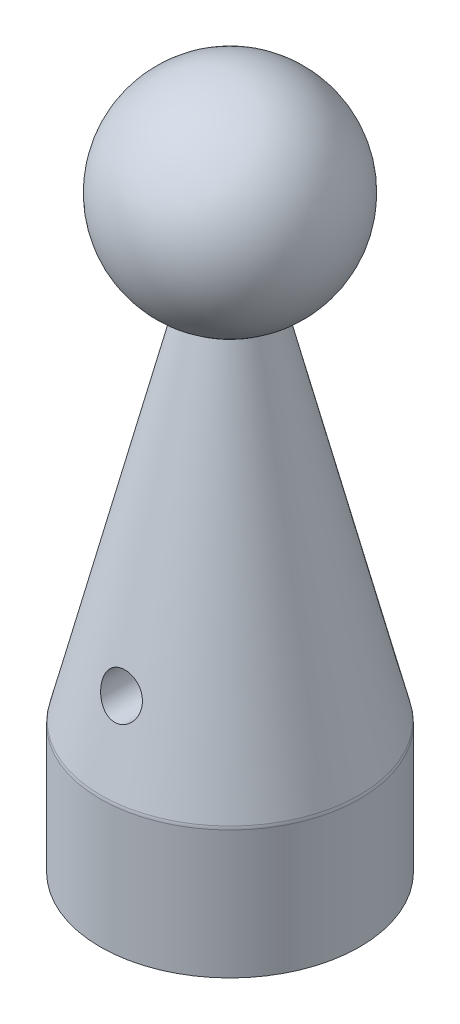
ISO-10303-21;
HEADER;
FILE_DESCRIPTION(('STEP AP214'),'2;1');
FILE_NAME('part.step','',(''),(''),'','','');
FILE_SCHEMA(('AUTOMOTIVE_DESIGN { 1 0 10303 214 1 1 1 1 }'));
ENDSEC;
DATA;
#1=APPLICATION_CONTEXT('core data for automotive mechanical design processes');
#2=APPLICATION_PROTOCOL_DEFINITION('international standard','automotive_design',2000,#1);
#3=PRODUCT_CONTEXT('',#1,'mechanical');
#4=PRODUCT('Part','Part','',(#3));
#5=PRODUCT_RELATED_PRODUCT_CATEGORY('part','',(#4));
#6=PRODUCT_DEFINITION_FORMATION('','',#4);
#7=PRODUCT_DEFINITION_CONTEXT('part definition',#1,'design');
#8=PRODUCT_DEFINITION('design','',#6,#7);
#9=PRODUCT_DEFINITION_SHAPE('','',#8);
#10=(LENGTH_UNIT() NAMED_UNIT(*) SI_UNIT(.MILLI.,.METRE.));
#11=(NAMED_UNIT(*) PLANE_ANGLE_UNIT() SI_UNIT($,.RADIAN.));
#12=(NAMED_UNIT(*) SI_UNIT($,.STERADIAN.) SOLID_ANGLE_UNIT());
#13=UNCERTAINTY_MEASURE_WITH_UNIT(LENGTH_MEASURE(1.E-05),#10,'distance_accuracy_value','');
#14=(GEOMETRIC_REPRESENTATION_CONTEXT(3) GLOBAL_UNCERTAINTY_ASSIGNED_CONTEXT((#13)) GLOBAL_UNIT_ASSIGNED_CONTEXT((#10,
#11,#12)) REPRESENTATION_CONTEXT('',''));
#15=CARTESIAN_POINT('',(0.,0.,0.));
#16=DIRECTION('',(0.,0.,1.));
#17=DIRECTION('',(1.,0.,0.));
#18=AXIS2_PLACEMENT_3D('',#15,#16,#17);
#19=CARTESIAN_POINT('',(0.,72.009,0.));
#20=DIRECTION('',(0.,-1.,0.));
#21=DIRECTION('',(1.,0.,0.));
#22=AXIS2_PLACEMENT_3D('',#19,#20,#21);
#23=SPHERICAL_SURFACE('',#22,12.7);
#24=CARTESIAN_POINT('',(0.,60.2357849017356,0.));
#25=DIRECTION('',(0.,-1.,0.));
#26=DIRECTION('',(0.,0.,-1.));
#27=AXIS2_PLACEMENT_3D('',#24,#25,#26);
#28=CIRCLE('',#27,4.7625);
#29=CARTESIAN_POINT('',(0.,60.2357849017356,-4.7625));
#30=VERTEX_POINT('',#29);
#31=EDGE_CURVE('E71',#30,#30,#28,.T.);
#32=ORIENTED_EDGE('',*,*,#31,.F.);
#33=EDGE_LOOP('',(#32));
#34=FACE_BOUND('',#33,.T.);
#35=ADVANCED_FACE('F35',(#34),#23,.T.);
#36=CARTESIAN_POINT('',(0.,15.875,0.));
#37=DIRECTION('',(0.,-1.,0.));
#38=DIRECTION('',(0.,0.,-1.));
#39=AXIS2_PLACEMENT_3D('',#36,#37,#38);
#40=CONICAL_SURFACE('',#39,15.875,0.245451813077684);
#41=CARTESIAN_POINT('',(0.,16.0664620543454,0.));
#42=DIRECTION('',(0.,1.,0.));
#43=DIRECTION('',(0.,0.,1.));
#44=AXIS2_PLACEMENT_3D('',#41,#42,#43);
#45=CIRCLE('',#44,15.8270382228667);
#46=CARTESIAN_POINT('',(0.,16.0664620543454,15.8270382228667));
#47=VERTEX_POINT('',#46);
#48=EDGE_CURVE('E174',#47,#47,#45,.T.);
#49=ORIENTED_EDGE('',*,*,#48,.T.);
#50=EDGE_LOOP('',(#49));
#51=FACE_BOUND('',#50,.T.);
#52=CARTESIAN_POINT('',(-1.58481914112109,23.4970012948583,-13.8754529950029));
#53=CARTESIAN_POINT('',(-1.6961829974814,23.5897522619588,-13.8393471086549));
#54=CARTESIAN_POINT('',(-1.79894269077523,23.6919255954184,-13.8004221577041));
#55=CARTESIAN_POINT('',(-1.98477756512118,23.9118781970244,-13.719259164654));
#56=CARTESIAN_POINT('',(-2.0678185568569,24.0296840263871,-13.6770155347589));
#57=CARTESIAN_POINT('',(-2.21207792475191,24.277386933347,-13.5915633702038));
#58=CARTESIAN_POINT('',(-2.27333159818721,24.4072640198637,-13.5483565178666));
#59=CARTESIAN_POINT('',(-2.37259631399215,24.675889208675,-13.4630049489034));
#60=CARTESIAN_POINT('',(-2.41061582390072,24.8146340587841,-13.4208598507033));
#61=CARTESIAN_POINT('',(-2.46248204757768,25.0992906698377,-13.3389371298532));
#62=CARTESIAN_POINT('',(-2.47600952646931,25.2452719490148,-13.2991972092676));
#63=CARTESIAN_POINT('',(-2.47696392774469,25.5385117917878,-13.2242928931891));
#64=CARTESIAN_POINT('',(-2.46439441660691,25.6857701781123,-13.189127873177));
#65=CARTESIAN_POINT('',(-2.41376499493418,25.9720143992584,-13.1255850793992));
#66=CARTESIAN_POINT('',(-2.37657529029136,26.1111119714139,-13.0970190316862));
#67=CARTESIAN_POINT('',(-2.27817455875988,26.3816706050399,-13.0456968924899));
#68=CARTESIAN_POINT('',(-2.21696967804379,26.51313361054,-13.0229393169095));
#69=CARTESIAN_POINT('',(-2.07505832373118,26.7588572648069,-12.9839557778314));
#70=CARTESIAN_POINT('',(-1.99524959624132,26.8736009832207,-12.9675011701351));
#71=CARTESIAN_POINT('',(-1.81712702073895,27.0883594104736,-12.9393340916822));
#72=CARTESIAN_POINT('',(-1.71881473598572,27.1883753623057,-12.9276212205869));
#73=CARTESIAN_POINT('',(-1.50816210203445,27.3691283332448,-12.9082864633968));
#74=CARTESIAN_POINT('',(-1.39606288156029,27.4501402172724,-12.9006039648537));
#75=CARTESIAN_POINT('',(-1.15983515940044,27.592452646085,-12.8881901690619));
#76=CARTESIAN_POINT('',(-1.03570657507021,27.653753055435,-12.8834588920904));
#77=CARTESIAN_POINT('',(-0.778592152559872,27.7549918128658,-12.8761464762223));
#78=CARTESIAN_POINT('',(-0.645584078874205,27.7948740843824,-12.8735709717866));
#79=CARTESIAN_POINT('',(-0.374757074092588,27.8518890552396,-12.8700108342314));
#80=CARTESIAN_POINT('',(-0.236938048700156,27.8690213084141,-12.8690262323121));
#81=CARTESIAN_POINT('',(0.0401498250046894,27.8800678663799,-12.8683828742834));
#82=CARTESIAN_POINT('',(0.179422171347654,27.873894903609,-12.8687291016196));
#83=CARTESIAN_POINT('',(0.45495681391569,27.8383115561259,-12.8708552532365));
#84=CARTESIAN_POINT('',(0.591219071340602,27.8089008720579,-12.8726351959868));
#85=CARTESIAN_POINT('',(0.856925223311006,27.7276682560728,-12.8780755340188));
#86=CARTESIAN_POINT('',(0.986365833935144,27.6758356388825,-12.8817368260224));
#87=CARTESIAN_POINT('',(1.2346581229638,27.5512696888629,-12.8916615747439));
#88=CARTESIAN_POINT('',(1.35351003876029,27.4785368247585,-12.8979249731063));
#89=CARTESIAN_POINT('',(1.57690969953443,27.3145633878721,-12.9139014642102));
#90=CARTESIAN_POINT('',(1.6814959427775,27.2233743452933,-12.9236050074536));
#91=CARTESIAN_POINT('',(1.87377852370752,27.0251372855796,-12.9473085207873));
#92=CARTESIAN_POINT('',(1.96147601389633,26.9180903514824,-12.9613081975368));
#93=CARTESIAN_POINT('',(2.1172476830594,26.6919314191681,-12.9941784241748));
#94=CARTESIAN_POINT('',(2.18540526162962,26.5728737212722,-13.0130276008846));
#95=CARTESIAN_POINT('',(2.30092589306694,26.3259454159872,-13.0559138134063));
#96=CARTESIAN_POINT('',(2.34828877666337,26.1980747368693,-13.0799508914459));
#97=CARTESIAN_POINT('',(2.42157598894163,25.9363165835197,-13.1332642932184));
#98=CARTESIAN_POINT('',(2.4473361678839,25.8023910473116,-13.1625787125716));
#99=CARTESIAN_POINT('',(2.47662193359034,25.5331886563844,-13.2257135780643));
#100=CARTESIAN_POINT('',(2.48014386426849,25.3979115831269,-13.2595347642068));
#101=CARTESIAN_POINT('',(2.46510774612966,25.1251140152942,-13.3318395410035));
#102=CARTESIAN_POINT('',(2.44582461966522,24.9876646031224,-13.3704393503084));
#103=CARTESIAN_POINT('',(2.38488298761727,24.7185013054369,-13.4499256708659));
#104=CARTESIAN_POINT('',(2.34321865438584,24.5867889233993,-13.4908127752022));
#105=CARTESIAN_POINT('',(2.23650468936039,24.3268450744616,-13.5749220284472));
#106=CARTESIAN_POINT('',(2.17054044286581,24.1989964969928,-13.6181697927702));
#107=CARTESIAN_POINT('',(2.01723172837341,23.9562401405798,-13.7031887206699));
#108=CARTESIAN_POINT('',(1.92988340331823,23.8413347016616,-13.7449596163059));
#109=CARTESIAN_POINT('',(1.73490208155059,23.6267652572838,-13.8251060819037));
#110=CARTESIAN_POINT('',(1.62709641166258,23.5272451337394,-13.863448332698));
#111=CARTESIAN_POINT('',(1.39429704159588,23.3480395117786,-13.9339049228625));
#112=CARTESIAN_POINT('',(1.269308881157,23.2683476437867,-13.9660212614939));
#113=CARTESIAN_POINT('',(1.0122709271217,23.1354427317042,-14.0203157133807));
#114=CARTESIAN_POINT('',(0.880899695043944,23.0810927523459,-14.0429148879074));
#115=CARTESIAN_POINT('',(0.609641311643584,22.995508413617,-14.0787575945503));
#116=CARTESIAN_POINT('',(0.469759465241613,22.9642598110406,-14.0920068911254));
#117=CARTESIAN_POINT('',(0.196709027462299,22.9277732066807,-14.1075018495034));
#118=CARTESIAN_POINT('',(0.0638161559361147,22.9207716417681,-14.1104934115393));
#119=CARTESIAN_POINT('',(-0.201281714344214,22.9281363352264,-14.107356091106));
#120=CARTESIAN_POINT('',(-0.33348671350848,22.942502580856,-14.1012272140751));
#121=CARTESIAN_POINT('',(-0.589123517075597,22.9911830686199,-14.0806222948175));
#122=CARTESIAN_POINT('',(-0.712700421776748,23.0248580496584,-14.0664138643047));
#123=CARTESIAN_POINT('',(-0.952195767953349,23.1103450947581,-14.030769320082));
#124=CARTESIAN_POINT('',(-1.06812045351481,23.1621421484899,-14.009339188573));
#125=CARTESIAN_POINT('',(-1.25130638532203,23.2612894425254,-13.96897515256));
#126=CARTESIAN_POINT('',(-1.32152614029901,23.3039763477081,-13.9517434745803));
#127=CARTESIAN_POINT('',(-1.45700833516107,23.3957852240179,-13.9151219355461));
#128=CARTESIAN_POINT('',(-1.52227086607108,23.4449070769409,-13.8957321141357));
#129=CARTESIAN_POINT('',(-1.58481914112109,23.4970012948583,-13.8754529950029));
#130=B_SPLINE_CURVE_WITH_KNOTS('',3,(#52,#53,#54,#55,#56,#57,#58,#59,#60,#61,#62,#63,#64,#65,
#66,#67,#68,#69,#70,#71,#72,#73,#74,#75,#76,#77,#78,#79,#80,#81,#82,#83,#84,#85,#86,#87,#88,#89,
#90,#91,#92,#93,#94,#95,#96,#97,#98,#99,#100,#101,#102,#103,#104,#105,#106,#107,#108,#109,#110,
#111,#112,#113,#114,#115,#116,#117,#118,#119,#120,#121,#122,#123,#124,#125,#126,#127,#128,#129),
.UNSPECIFIED.,.T.,.F.,(4,2,2,2,2,2,2,2,2,2,2,2,2,2,2,2,2,2,2,2,2,2,2,2,2,2,2,2,2,2,2,2,2,2,2,2,
2,2,4),(0.,0.447761055793531,0.896292885182048,1.34409470977817,1.79173323845068,
2.24516550456591,2.69853580759798,3.13668082210654,3.57471377579887,3.99487146188258,
4.41499366717724,4.8286021527948,5.24221348020054,5.65690250182928,6.07159965608931,
6.48785120232547,6.90410811093269,7.32056360755218,7.73700976514706,8.15230884656,
8.5675795775853,8.98105053768155,9.39452486340583,9.81111324628355,10.227770116719,
10.6580385257683,11.0884190230126,11.5370038816743,11.9856697115104,12.4383061183082,
12.8907969331254,13.3203635282876,13.7496650518099,14.1469994741183,14.5443336595018,
14.9292157646329,15.3137798276022,15.5652725199751,15.8167605933034),.UNSPECIFIED.);
#131=CARTESIAN_POINT('',(-1.58481914112109,23.4970012948583,-13.8754529950029));
#132=VERTEX_POINT('',#131);
#133=EDGE_CURVE('E81',#132,#132,#130,.T.);
#134=ORIENTED_EDGE('',*,*,#133,.F.);
#135=EDGE_LOOP('',(#134));
#136=FACE_BOUND('',#135,.T.);
#137=CARTESIAN_POINT('',(-1.89508168074414,23.8057234639181,13.7584309871721));
#138=CARTESIAN_POINT('',(-1.80739588664017,23.7014970993152,13.7968637910234));
#139=CARTESIAN_POINT('',(-1.71080792118455,23.6041620553417,13.8338557899135));
#140=CARTESIAN_POINT('',(-1.50180280397837,23.4260446703507,13.9029799169636));
#141=CARTESIAN_POINT('',(-1.38937931794877,23.3452689850543,13.935110089651));
#142=CARTESIAN_POINT('',(-1.15094732351897,23.2027962020286,13.9926365070573));
#143=CARTESIAN_POINT('',(-1.02490050052905,23.141154905256,14.0180130261962));
#144=CARTESIAN_POINT('',(-0.762945501580123,23.0397742257333,14.0601370813107));
#145=CARTESIAN_POINT('',(-0.62704204834928,23.0000244312775,14.0768887190748));
#146=CARTESIAN_POINT('',(-0.357111418262381,22.9457291194887,14.099854570557));
#147=CARTESIAN_POINT('',(-0.223378583746677,22.9299395165922,14.1065885253948));
#148=CARTESIAN_POINT('',(0.0450065469856636,22.9202733746445,14.1107051556651));
#149=CARTESIAN_POINT('',(0.179658608884312,22.9263914451029,14.1080901314598));
#150=CARTESIAN_POINT('',(0.439938124246107,22.9595123839307,14.0940217768419));
#151=CARTESIAN_POINT('',(0.565704399885344,22.9856036909176,14.0829542611985));
#152=CARTESIAN_POINT('',(0.810863205163403,23.0565322263799,14.0531715957073));
#153=CARTESIAN_POINT('',(0.9302552836426,23.1013707797892,14.0344559053382));
#154=CARTESIAN_POINT('',(1.16244095705938,23.2094377262236,13.9899948882622));
#155=CARTESIAN_POINT('',(1.27501698542624,23.2730689253708,13.9640964358011));
#156=CARTESIAN_POINT('',(1.48802479949498,23.4162365952943,13.9069414729731));
#157=CARTESIAN_POINT('',(1.58845306155889,23.4957776632925,13.8756834142996));
#158=CARTESIAN_POINT('',(1.78164572485805,23.6745228056438,13.8071060561963));
#159=CARTESIAN_POINT('',(1.8734138032958,23.7747006159258,13.7695182229504));
#160=CARTESIAN_POINT('',(2.03906316012397,23.9880748253056,13.6919286600419));
#161=CARTESIAN_POINT('',(2.11293813048738,24.101275794897,13.6519260852781));
#162=CARTESIAN_POINT('',(2.24529283084376,24.3454071176251,13.5688249757992));
#163=CARTESIAN_POINT('',(2.30252579166013,24.4770027802847,13.5256888946975));
#164=CARTESIAN_POINT('',(2.39355694036999,24.7485081042053,13.4408010622832));
#165=CARTESIAN_POINT('',(2.42735222462867,24.8884187932636,13.399049483103));
#166=CARTESIAN_POINT('',(2.47051144443493,25.1745987050283,13.3182560044348));
#167=CARTESIAN_POINT('',(2.47957958919367,25.3209238141584,13.2792523024954));
#168=CARTESIAN_POINT('',(2.47158051984545,25.6140672341351,13.2060432853171));
#169=CARTESIAN_POINT('',(2.45451956502381,25.7608854184583,13.171836823031));
#170=CARTESIAN_POINT('',(2.3952504093922,26.045081139306,13.1103772841999));
#171=CARTESIAN_POINT('',(2.35397432770692,26.1826080564141,13.0829174170998));
#172=CARTESIAN_POINT('',(2.24779185542904,26.4493190717815,13.0337846351157));
#173=CARTESIAN_POINT('',(2.18289100775873,26.57850511864,13.0121103648613));
#174=CARTESIAN_POINT('',(2.03414808635893,26.8193443481147,12.9751096306376));
#175=CARTESIAN_POINT('',(1.95115121637183,26.9314872220789,12.9595670625528));
#176=CARTESIAN_POINT('',(1.76718800338593,27.1405400466856,12.9330775933627));
#177=CARTESIAN_POINT('',(1.66622294108217,27.2374510820612,12.9221303649082));
#178=CARTESIAN_POINT('',(1.45066484469117,27.4118635074047,12.904124028197));
#179=CARTESIAN_POINT('',(1.33626976460986,27.4896047075482,12.8970153998268));
#180=CARTESIAN_POINT('',(1.09604042984677,27.6250304007714,12.8856016250783));
#181=CARTESIAN_POINT('',(0.970206073352255,27.6827147153172,12.8812965036546));
#182=CARTESIAN_POINT('',(0.7102285514194,27.7765071805949,12.8747162421717));
#183=CARTESIAN_POINT('',(0.57605983700351,27.812544967223,12.87244771055));
#184=CARTESIAN_POINT('',(0.303571897670242,27.8617197990151,12.8694327594188));
#185=CARTESIAN_POINT('',(0.165252589678017,27.8748563854962,12.868686370396));
#186=CARTESIAN_POINT('',(-0.11212225609576,27.8778586674375,12.868511914043));
#187=CARTESIAN_POINT('',(-0.251178681393938,27.8676432768015,12.8690884403562));
#188=CARTESIAN_POINT('',(-0.525603609660362,27.824065859309,12.8717289939219));
#189=CARTESIAN_POINT('',(-0.660972072199573,27.7907035788124,12.8737930374742));
#190=CARTESIAN_POINT('',(-0.924200251411285,27.7017837898515,12.8799092982021));
#191=CARTESIAN_POINT('',(-1.05205829683047,27.646221362606,12.8839619560309));
#192=CARTESIAN_POINT('',(-1.29657477145949,27.5145276224455,12.8948126682358));
#193=CARTESIAN_POINT('',(-1.41323350245472,27.4383968639914,12.9016106486086));
#194=CARTESIAN_POINT('',(-1.6316725061409,27.2681049707059,12.9188044276343));
#195=CARTESIAN_POINT('',(-1.73349730514124,27.173999839965,12.9291891300365));
#196=CARTESIAN_POINT('',(-1.91981264647512,26.9704785046652,12.9543818459711));
#197=CARTESIAN_POINT('',(-2.00430432462991,26.8610633041498,12.9691895695114));
#198=CARTESIAN_POINT('',(-2.15337331138446,26.6307624646678,13.0037526965259));
#199=CARTESIAN_POINT('',(-2.21802918072555,26.5099246218499,13.023488005166));
#200=CARTESIAN_POINT('',(-2.32633590415451,26.26008933137,13.0681519336564));
#201=CARTESIAN_POINT('',(-2.36998681926477,26.131091907414,13.0930805384193));
#202=CARTESIAN_POINT('',(-2.43580404175481,25.8674842724065,13.1481605986364));
#203=CARTESIAN_POINT('',(-2.45776535561874,25.7328328165642,13.1783587716303));
#204=CARTESIAN_POINT('',(-2.47940963405145,25.4627833210038,13.2431328191021));
#205=CARTESIAN_POINT('',(-2.47908567387534,25.3273850622986,13.2777100509617));
#206=CARTESIAN_POINT('',(-2.45624917294787,25.0546421165594,13.3514293826135));
#207=CARTESIAN_POINT('',(-2.43296261032755,24.9173944274575,13.3906886842787));
#208=CARTESIAN_POINT('',(-2.36403520713375,24.6493087944196,13.4712152661129));
#209=CARTESIAN_POINT('',(-2.31840239710237,24.5184685664094,13.5124818201435));
#210=CARTESIAN_POINT('',(-2.21522989315583,24.2868167579375,13.5885326883595));
#211=CARTESIAN_POINT('',(-2.16083010989988,24.1845805456837,13.6232806584537));
#212=CARTESIAN_POINT('',(-2.03813790242924,23.9884674883579,13.6918452214665));
#213=CARTESIAN_POINT('',(-1.96984567173707,23.8945905268673,13.7256618273516));
#214=CARTESIAN_POINT('',(-1.89508168074414,23.8057234639181,13.7584309871721));
#215=B_SPLINE_CURVE_WITH_KNOTS('',3,(#137,#138,#139,#140,#141,#142,#143,#144,#145,#146,#147,
#148,#149,#150,#151,#152,#153,#154,#155,#156,#157,#158,#159,#160,#161,#162,#163,#164,#165,#166,
#167,#168,#169,#170,#171,#172,#173,#174,#175,#176,#177,#178,#179,#180,#181,#182,#183,#184,#185,
#186,#187,#188,#189,#190,#191,#192,#193,#194,#195,#196,#197,#198,#199,#200,#201,#202,#203,#204,
#205,#206,#207,#208,#209,#210,#211,#212,#213,#214),.UNSPECIFIED.,.T.,.F.,(4,2,2,2,2,2,2,2,2,2,2,
2,2,2,2,2,2,2,2,2,2,2,2,2,2,2,2,2,2,2,2,2,2,2,2,2,2,2,4),(0.,0.424175562980807,
0.848521282480758,1.27409312646216,1.69946239121182,2.10188276724729,2.50420413258058,
2.8891842895741,3.2741916590715,3.66813818143896,4.06219870114189,4.48325446003886,
4.9044584423599,5.3519191065878,5.79943519569433,6.25228154949979,6.70501943989653,
7.14137797522517,7.57763419656153,7.99673511830483,8.41580618030213,8.82933335042358,
9.24286420141166,9.65773210000356,10.072608307794,10.4889272957566,10.9052508457523,
11.321666689777,11.7380713095872,12.1531990684878,12.5682996158053,12.981734255769,
13.3951676946389,13.8124722302299,14.2299064362254,14.6619097550174,15.0937579391386,
15.4554299754662,15.8170969740283),.UNSPECIFIED.);
#216=CARTESIAN_POINT('',(-1.89508168074414,23.8057234639181,13.7584309871721));
#217=VERTEX_POINT('',#216);
#218=EDGE_CURVE('E85',#217,#217,#215,.T.);
#219=ORIENTED_EDGE('',*,*,#218,.F.);
#220=EDGE_LOOP('',(#219));
#221=FACE_BOUND('',#220,.T.);
#222=ORIENTED_EDGE('',*,*,#31,.T.);
#223=EDGE_LOOP('',(#222));
#224=FACE_BOUND('',#223,.T.);
#225=ADVANCED_FACE('F129',(#51,#136,#221,#224),#40,.T.);
#226=CARTESIAN_POINT('',(0.,0.,0.));
#227=DIRECTION('',(0.,-1.,0.));
#228=DIRECTION('',(0.,0.,-1.));
#229=AXIS2_PLACEMENT_3D('',#226,#227,#228);
#230=CYLINDRICAL_SURFACE('',#229,15.875);
#231=CARTESIAN_POINT('',(0.,15.6776220622259,0.));
#232=DIRECTION('',(0.,1.,0.));
#233=DIRECTION('',(0.,0.,1.));
#234=AXIS2_PLACEMENT_3D('',#231,#232,#233);
#235=CIRCLE('',#234,15.875);
#236=CARTESIAN_POINT('',(0.,15.6776220622259,15.875));
#237=VERTEX_POINT('',#236);
#238=EDGE_CURVE('E178',#237,#237,#235,.F.);
#239=ORIENTED_EDGE('',*,*,#238,.T.);
#240=EDGE_LOOP('',(#239));
#241=FACE_BOUND('',#240,.T.);
#242=CARTESIAN_POINT('',(0.,0.,0.));
#243=DIRECTION('',(0.,-1.,0.));
#244=DIRECTION('',(0.,0.,-1.));
#245=AXIS2_PLACEMENT_3D('',#242,#243,#244);
#246=CIRCLE('',#245,15.875);
#247=CARTESIAN_POINT('',(0.,0.,-15.875));
#248=VERTEX_POINT('',#247);
#249=EDGE_CURVE('E95',#248,#248,#246,.T.);
#250=ORIENTED_EDGE('',*,*,#249,.F.);
#251=EDGE_LOOP('',(#250));
#252=FACE_BOUND('',#251,.T.);
#253=ADVANCED_FACE('F134',(#241,#252),#230,.T.);
#254=CARTESIAN_POINT('',(15.875,0.,0.));
#255=DIRECTION('',(0.,-1.,0.));
#256=DIRECTION('',(0.,0.,-1.));
#257=AXIS2_PLACEMENT_3D('',#254,#255,#256);
#258=PLANE('',#257);
#259=CARTESIAN_POINT('',(0.,0.,0.));
#260=DIRECTION('',(0.,-1.,0.));
#261=DIRECTION('',(0.,0.,-1.));
#262=AXIS2_PLACEMENT_3D('',#259,#260,#261);
#263=CIRCLE('',#262,9.67739999999999);
#264=CARTESIAN_POINT('',(0.,0.,-9.67739999999999));
#265=VERTEX_POINT('',#264);
#266=EDGE_CURVE('E154',#265,#265,#263,.F.);
#267=ORIENTED_EDGE('',*,*,#266,.T.);
#268=EDGE_LOOP('',(#267));
#269=FACE_BOUND('',#268,.T.);
#270=ORIENTED_EDGE('',*,*,#249,.T.);
#271=EDGE_LOOP('',(#270));
#272=FACE_BOUND('',#271,.T.);
#273=ADVANCED_FACE('F159',(#269,#272),#258,.T.);
#274=CARTESIAN_POINT('',(9.2075,0.469899999999999,0.));
#275=DIRECTION('',(0.,-1.,0.));
#276=DIRECTION('',(0.,0.,-1.));
#277=AXIS2_PLACEMENT_3D('',#274,#275,#276);
#278=PLANE('',#277);
#279=CARTESIAN_POINT('',(0.,0.469899999999999,0.));
#280=DIRECTION('',(0.,-1.,0.));
#281=DIRECTION('',(0.,0.,-1.));
#282=AXIS2_PLACEMENT_3D('',#279,#280,#281);
#283=CIRCLE('',#282,4.82299999999999);
#284=CARTESIAN_POINT('',(0.,0.469899999999999,-4.82299999999999));
#285=VERTEX_POINT('',#284);
#286=EDGE_CURVE('E11',#285,#285,#283,.F.);
#287=ORIENTED_EDGE('',*,*,#286,.T.);
#288=EDGE_LOOP('',(#287));
#289=FACE_BOUND('',#288,.T.);
#290=CARTESIAN_POINT('',(0.,0.469899999999998,0.));
#291=DIRECTION('',(0.,-1.,0.));
#292=DIRECTION('',(0.,0.,-1.));
#293=AXIS2_PLACEMENT_3D('',#290,#291,#292);
#294=CIRCLE('',#293,9.2075);
#295=CARTESIAN_POINT('',(0.,0.469899999999998,-9.2075));
#296=VERTEX_POINT('',#295);
#297=EDGE_CURVE('E83',#296,#296,#294,.T.);
#298=ORIENTED_EDGE('',*,*,#297,.T.);
#299=EDGE_LOOP('',(#298));
#300=FACE_BOUND('',#299,.T.);
#301=ADVANCED_FACE('F157',(#289,#300),#278,.T.);
#302=CARTESIAN_POINT('',(0.,0.,0.));
#303=DIRECTION('',(0.,-1.,0.));
#304=DIRECTION('',(0.,0.,-1.));
#305=AXIS2_PLACEMENT_3D('',#302,#303,#304);
#306=CYLINDRICAL_SURFACE('',#305,4.188);
#307=CARTESIAN_POINT('',(0.,1.10489999999999,0.));
#308=DIRECTION('',(0.,-1.,0.));
#309=DIRECTION('',(0.,0.,-1.));
#310=AXIS2_PLACEMENT_3D('',#307,#308,#309);
#311=CIRCLE('',#310,4.188);
#312=CARTESIAN_POINT('',(0.,1.10489999999999,-4.188));
#313=VERTEX_POINT('',#312);
#314=EDGE_CURVE('E43',#313,#313,#311,.T.);
#315=ORIENTED_EDGE('',*,*,#314,.T.);
#316=EDGE_LOOP('',(#315));
#317=FACE_BOUND('',#316,.T.);
#318=CARTESIAN_POINT('',(2.38732149441632,26.0585957275126,3.44093593115272));
#319=CARTESIAN_POINT('',(2.40254606615157,26.0034360831638,3.43036559807257));
#320=CARTESIAN_POINT('',(2.41590522332935,25.947525497524,3.42095433279258));
#321=CARTESIAN_POINT('',(2.43875983843176,25.8345315943411,3.4047033753821));
#322=CARTESIAN_POINT('',(2.44825376673219,25.7774478218908,3.39786470140912));
#323=CARTESIAN_POINT('',(2.46320669897485,25.6626811801733,3.38704002199089));
#324=CARTESIAN_POINT('',(2.46867964816858,25.6050010917639,3.38304415886867));
#325=CARTESIAN_POINT('',(2.47556934414219,25.4892962060004,3.37800442210918));
#326=CARTESIAN_POINT('',(2.47698687281313,25.4312714772555,3.37695997943416));
#327=CARTESIAN_POINT('',(2.47509079480876,25.2570200173428,3.37835995583196));
#328=CARTESIAN_POINT('',(2.46560371002346,25.1408062359759,3.38535597210646));
#329=CARTESIAN_POINT('',(2.43073514851509,24.9121497273127,3.4104693475199));
#330=CARTESIAN_POINT('',(2.40535175875358,24.7997074556143,3.4285880452111));
#331=CARTESIAN_POINT('',(2.33989806110003,24.5808513821999,3.47358408355127));
#332=CARTESIAN_POINT('',(2.29979927311183,24.4744497356917,3.50047839721247));
#333=CARTESIAN_POINT('',(2.20626422121754,24.26943722709,3.56017084889358));
#334=CARTESIAN_POINT('',(2.15281663999829,24.1708330697036,3.59297398989617));
#335=CARTESIAN_POINT('',(2.0230990757247,23.9656482332995,3.6678283387734));
#336=CARTESIAN_POINT('',(1.94445847359474,23.8607839003191,3.71048528891409));
#337=CARTESIAN_POINT('',(1.77169556089981,23.6647072490362,3.79601690708993));
#338=CARTESIAN_POINT('',(1.67756192349439,23.5735050128713,3.8388917120052));
#339=CARTESIAN_POINT('',(1.46335491801383,23.396732871263,3.92591178326511));
#340=CARTESIAN_POINT('',(1.34153989333902,23.3130390457757,3.9696289527514));
#341=CARTESIAN_POINT('',(1.08267296949936,23.1677710922212,4.04788737497179));
#342=CARTESIAN_POINT('',(0.945631991681397,23.1061812417407,4.08243514526563));
#343=CARTESIAN_POINT('',(0.67160178685569,23.0122686831255,4.13596293940517));
#344=CARTESIAN_POINT('',(0.535487174627743,22.9779972776583,4.15596805351775));
#345=CARTESIAN_POINT('',(0.258176033281708,22.933004070408,4.18234561625436));
#346=CARTESIAN_POINT('',(0.116984903881012,22.9222579572193,4.18873213836738));
#347=CARTESIAN_POINT('',(-0.147114153973731,22.9248024559366,4.18723184516187));
#348=CARTESIAN_POINT('',(-0.270071913801989,22.9352199692572,4.18105102962424));
#349=CARTESIAN_POINT('',(-0.512139331952094,22.9739360783132,4.15834472591158));
#350=CARTESIAN_POINT('',(-0.631248789590982,23.0022356049907,4.14181869916263));
#351=CARTESIAN_POINT('',(-0.861810942329922,23.0751610842946,4.10003478964375));
#352=CARTESIAN_POINT('',(-0.973307640520492,23.1196817190783,4.07483329058162));
#353=CARTESIAN_POINT('',(-1.18732077740118,23.2234254344386,4.01769788615131));
#354=CARTESIAN_POINT('',(-1.28983554561586,23.2826512420902,3.98576273219227));
#355=CARTESIAN_POINT('',(-1.49524972806455,23.4215361714754,3.91365540093647));
#356=CARTESIAN_POINT('',(-1.59692309288241,23.502735507178,3.8729620991524));
#357=CARTESIAN_POINT('',(-1.78604548905856,23.6795673466781,3.78947221683918));
#358=CARTESIAN_POINT('',(-1.87347381436295,23.7752204777798,3.74667269030344));
#359=CARTESIAN_POINT('',(-2.0421778005952,23.9916095024621,3.65772865892316));
#360=CARTESIAN_POINT('',(-2.12148790775197,24.1139752949142,3.61179099734607));
#361=CARTESIAN_POINT('',(-2.25815055806517,24.3728069840509,3.52796689664206));
#362=CARTESIAN_POINT('',(-2.31554660827355,24.5092442523009,3.49006457184503));
#363=CARTESIAN_POINT('',(-2.39521163048801,24.7603517587797,3.43570520755091));
#364=CARTESIAN_POINT('',(-2.42252841357838,24.8727880434551,3.41631856706168));
#365=CARTESIAN_POINT('',(-2.46120339357181,25.101758910158,3.38857229017809));
#366=CARTESIAN_POINT('',(-2.47257485416305,25.2182900032101,3.38020348924443));
#367=CARTESIAN_POINT('',(-2.47725657668939,25.3961571367987,3.3767625133769));
#368=CARTESIAN_POINT('',(-2.47659131060474,25.4573332211776,3.37725448437703));
#369=CARTESIAN_POINT('',(-2.47074874011488,25.5793847944586,3.3815325697189));
#370=CARTESIAN_POINT('',(-2.46557028941343,25.6402602030419,3.38531952094677));
#371=CARTESIAN_POINT('',(-2.45073867123322,25.7614999760104,3.39607283098467));
#372=CARTESIAN_POINT('',(-2.44106181413965,25.8218598906724,3.40305601885718));
#373=CARTESIAN_POINT('',(-2.41738944090324,25.9412913918185,3.4199072243595));
#374=CARTESIAN_POINT('',(-2.40339584477076,26.0003635385976,3.42977395933532));
#375=CARTESIAN_POINT('',(-2.38732149441632,26.0585957275126,3.44093593115272));
#376=B_SPLINE_CURVE_WITH_KNOTS('',3,(#318,#319,#320,#321,#322,#323,#324,#325,#326,#327,#328,
#329,#330,#331,#332,#333,#334,#335,#336,#337,#338,#339,#340,#341,#342,#343,#344,#345,#346,#347,
#348,#349,#350,#351,#352,#353,#354,#355,#356,#357,#358,#359,#360,#361,#362,#363,#364,#365,#366,
#367,#368,#369,#370,#371,#372,#373,#374,#375),.UNSPECIFIED.,.F.,.F.,(4,2,2,2,2,2,2,2,2,2,2,2,2,
2,2,2,2,2,2,2,2,2,2,2,2,2,2,2,4),(0.,0.174544086649143,0.349157180322339,0.523161798135872,
0.697132865340029,1.04564520528764,1.39419949496269,1.74343196324738,2.0929615273167,
2.50486163473532,2.9170642278703,3.37701323594812,3.83663443384471,4.25945038944834,
4.68182919375024,5.0506895974761,5.41956920575114,5.78609528852092,6.15268939440798,
6.56006808931372,6.96803375143941,7.42447638214553,7.88000804348641,8.23051410213111,
8.58072842841889,8.7640546458006,8.94742743947737,9.13177704953127,9.31604478202655),.UNSPECIFIED.);
#377=CARTESIAN_POINT('',(2.38732149441632,26.0585957275126,3.44093593115272));
#378=VERTEX_POINT('',#377);
#379=CARTESIAN_POINT('',(-2.38732149441632,26.0585957275126,3.44093593115272));
#380=VERTEX_POINT('',#379);
#381=EDGE_CURVE('E49',#378,#380,#376,.T.);
#382=ORIENTED_EDGE('',*,*,#381,.F.);
#383=CARTESIAN_POINT('',(0.,26.0585957275126,0.));
#384=DIRECTION('',(0.,-1.,0.));
#385=DIRECTION('',(0.,0.,-1.));
#386=AXIS2_PLACEMENT_3D('',#383,#384,#385);
#387=CIRCLE('',#386,4.188);
#388=CARTESIAN_POINT('',(2.38732149441632,26.0585957275126,-3.44093593115272));
#389=VERTEX_POINT('',#388);
#390=EDGE_CURVE('E77',#389,#378,#387,.T.);
#391=ORIENTED_EDGE('',*,*,#390,.F.);
#392=CARTESIAN_POINT('',(-2.38732149441632,26.0585957275126,-3.44093593115272));
#393=CARTESIAN_POINT('',(-2.40254606615157,26.0034360831638,-3.43036559807257));
#394=CARTESIAN_POINT('',(-2.41590522332935,25.947525497524,-3.42095433279258));
#395=CARTESIAN_POINT('',(-2.43875983843176,25.8345315943411,-3.4047033753821));
#396=CARTESIAN_POINT('',(-2.44825376673219,25.7774478218908,-3.39786470140912));
#397=CARTESIAN_POINT('',(-2.46320669897485,25.6626811801733,-3.38704002199089));
#398=CARTESIAN_POINT('',(-2.46867964816858,25.6050010917639,-3.38304415886867));
#399=CARTESIAN_POINT('',(-2.47556934414219,25.4892962060004,-3.37800442210918));
#400=CARTESIAN_POINT('',(-2.47698687281313,25.4312714772555,-3.37695997943416));
#401=CARTESIAN_POINT('',(-2.47509079480876,25.2570200173428,-3.37835995583196));
#402=CARTESIAN_POINT('',(-2.46560371002346,25.1408062359759,-3.38535597210646));
#403=CARTESIAN_POINT('',(-2.43073514851509,24.9121497273127,-3.4104693475199));
#404=CARTESIAN_POINT('',(-2.40535175875358,24.7997074556143,-3.4285880452111));
#405=CARTESIAN_POINT('',(-2.33989806110003,24.5808513821999,-3.47358408355127));
#406=CARTESIAN_POINT('',(-2.29979927311183,24.4744497356917,-3.50047839721247));
#407=CARTESIAN_POINT('',(-2.20626422121754,24.26943722709,-3.56017084889358));
#408=CARTESIAN_POINT('',(-2.15281663999829,24.1708330697036,-3.59297398989617));
#409=CARTESIAN_POINT('',(-2.0230990757247,23.9656482332995,-3.6678283387734));
#410=CARTESIAN_POINT('',(-1.94445847359474,23.8607839003191,-3.71048528891409));
#411=CARTESIAN_POINT('',(-1.77169556089981,23.6647072490362,-3.79601690708993));
#412=CARTESIAN_POINT('',(-1.67756192349439,23.5735050128713,-3.8388917120052));
#413=CARTESIAN_POINT('',(-1.46335491801383,23.396732871263,-3.92591178326511));
#414=CARTESIAN_POINT('',(-1.34153989333902,23.3130390457757,-3.9696289527514));
#415=CARTESIAN_POINT('',(-1.08267296949936,23.1677710922212,-4.04788737497179));
#416=CARTESIAN_POINT('',(-0.945631991681397,23.1061812417407,-4.08243514526563));
#417=CARTESIAN_POINT('',(-0.67160178685569,23.0122686831255,-4.13596293940517));
#418=CARTESIAN_POINT('',(-0.535487174627743,22.9779972776583,-4.15596805351775));
#419=CARTESIAN_POINT('',(-0.258176033281708,22.933004070408,-4.18234561625436));
#420=CARTESIAN_POINT('',(-0.116984903881012,22.9222579572193,-4.18873213836738));
#421=CARTESIAN_POINT('',(0.147114153973731,22.9248024559366,-4.18723184516187));
#422=CARTESIAN_POINT('',(0.270071913801989,22.9352199692572,-4.18105102962424));
#423=CARTESIAN_POINT('',(0.512139331952094,22.9739360783132,-4.15834472591158));
#424=CARTESIAN_POINT('',(0.631248789590982,23.0022356049907,-4.14181869916263));
#425=CARTESIAN_POINT('',(0.861810942329922,23.0751610842946,-4.10003478964375));
#426=CARTESIAN_POINT('',(0.973307640520492,23.1196817190783,-4.07483329058162));
#427=CARTESIAN_POINT('',(1.18732077740118,23.2234254344386,-4.01769788615131));
#428=CARTESIAN_POINT('',(1.28983554561586,23.2826512420902,-3.98576273219227));
#429=CARTESIAN_POINT('',(1.49524972806455,23.4215361714754,-3.91365540093647));
#430=CARTESIAN_POINT('',(1.59692309288241,23.502735507178,-3.8729620991524));
#431=CARTESIAN_POINT('',(1.78604548905856,23.6795673466781,-3.78947221683918));
#432=CARTESIAN_POINT('',(1.87347381436295,23.7752204777798,-3.74667269030344));
#433=CARTESIAN_POINT('',(2.0421778005952,23.9916095024621,-3.65772865892316));
#434=CARTESIAN_POINT('',(2.12148790775197,24.1139752949142,-3.61179099734607));
#435=CARTESIAN_POINT('',(2.25815055806517,24.3728069840509,-3.52796689664206));
#436=CARTESIAN_POINT('',(2.31554660827355,24.5092442523009,-3.49006457184503));
#437=CARTESIAN_POINT('',(2.39521163048801,24.7603517587797,-3.43570520755091));
#438=CARTESIAN_POINT('',(2.42252841357838,24.8727880434551,-3.41631856706168));
#439=CARTESIAN_POINT('',(2.46120339357181,25.101758910158,-3.38857229017809));
#440=CARTESIAN_POINT('',(2.47257485416305,25.2182900032101,-3.38020348924443));
#441=CARTESIAN_POINT('',(2.47725657668939,25.3961571367987,-3.3767625133769));
#442=CARTESIAN_POINT('',(2.47659131060474,25.4573332211776,-3.37725448437703));
#443=CARTESIAN_POINT('',(2.47074874011488,25.5793847944586,-3.3815325697189));
#444=CARTESIAN_POINT('',(2.46557028941343,25.6402602030419,-3.38531952094677));
#445=CARTESIAN_POINT('',(2.45073867123322,25.7614999760104,-3.39607283098467));
#446=CARTESIAN_POINT('',(2.44106181413965,25.8218598906724,-3.40305601885718));
#447=CARTESIAN_POINT('',(2.41738944090324,25.9412913918185,-3.4199072243595));
#448=CARTESIAN_POINT('',(2.40339584477076,26.0003635385976,-3.42977395933532));
#449=CARTESIAN_POINT('',(2.38732149441632,26.0585957275126,-3.44093593115272));
#450=B_SPLINE_CURVE_WITH_KNOTS('',3,(#392,#393,#394,#395,#396,#397,#398,#399,#400,#401,#402,
#403,#404,#405,#406,#407,#408,#409,#410,#411,#412,#413,#414,#415,#416,#417,#418,#419,#420,#421,
#422,#423,#424,#425,#426,#427,#428,#429,#430,#431,#432,#433,#434,#435,#436,#437,#438,#439,#440,
#441,#442,#443,#444,#445,#446,#447,#448,#449),.UNSPECIFIED.,.F.,.F.,(4,2,2,2,2,2,2,2,2,2,2,2,2,
2,2,2,2,2,2,2,2,2,2,2,2,2,2,2,4),(0.,0.174544086649143,0.349157180322339,0.523161798135872,
0.697132865340029,1.04564520528764,1.39419949496269,1.74343196324738,2.0929615273167,
2.50486163473532,2.9170642278703,3.37701323594812,3.83663443384471,4.25945038944834,
4.68182919375024,5.0506895974761,5.41956920575114,5.78609528852092,6.15268939440798,
6.56006808931372,6.96803375143941,7.42447638214553,7.88000804348641,8.23051410213111,
8.58072842841889,8.7640546458006,8.94742743947737,9.13177704953127,9.31604478202655),.UNSPECIFIED.);
#451=CARTESIAN_POINT('',(-2.38732149441632,26.0585957275126,-3.44093593115272));
#452=VERTEX_POINT('',#451);
#453=EDGE_CURVE('E56',#452,#389,#450,.T.);
#454=ORIENTED_EDGE('',*,*,#453,.F.);
#455=EDGE_CURVE('E76',#380,#452,#387,.T.);
#456=ORIENTED_EDGE('',*,*,#455,.F.);
#457=EDGE_LOOP('',(#382,#391,#454,#456));
#458=FACE_BOUND('',#457,.T.);
#459=ADVANCED_FACE('F75',(#317,#458),#306,.F.);
#460=CARTESIAN_POINT('',(0.,28.575,0.));
#461=DIRECTION('',(0.,-1.,0.));
#462=DIRECTION('',(0.,0.,-1.));
#463=AXIS2_PLACEMENT_3D('',#460,#461,#462);
#464=CONICAL_SURFACE('',#463,0.,1.02974425867666);
#465=CARTESIAN_POINT('',(-2.43020567807756,25.8766053002638,3.77652351900787));
#466=CARTESIAN_POINT('',(-2.42111243647217,25.9229304259185,3.69069666742426));
#467=CARTESIAN_POINT('',(-2.41064847372646,25.9693108622482,3.60503807745724));
#468=CARTESIAN_POINT('',(-2.38680343022463,26.0622183700116,3.4341678369547));
#469=CARTESIAN_POINT('',(-2.37342128661752,26.1087454887685,3.34895636087587));
#470=CARTESIAN_POINT('',(-2.34336217711679,26.2025993315363,3.17796805808241));
#471=CARTESIAN_POINT('',(-2.32664181264733,26.2499281489118,3.09219995192261));
#472=CARTESIAN_POINT('',(-2.28977206063493,26.3447673554102,2.92152017261694));
#473=CARTESIAN_POINT('',(-2.26962323211823,26.3922777136995,2.83660836223541));
#474=CARTESIAN_POINT('',(-2.22388590015212,26.4911331065276,2.66154573835591));
#475=CARTESIAN_POINT('',(-2.19800192623908,26.5424973540911,2.57148222670334));
#476=CARTESIAN_POINT('',(-2.14125614783634,26.6456082501853,2.3931641049202));
#477=CARTESIAN_POINT('',(-2.11039530741551,26.6973548228072,2.30490914817868));
#478=CARTESIAN_POINT('',(-2.04297749090274,26.8011083474162,2.131484068438));
#479=CARTESIAN_POINT('',(-2.00645343496055,26.8531122109963,2.04629941931836));
#480=CARTESIAN_POINT('',(-1.92626568083259,26.9578559586728,1.87987971375774));
#481=CARTESIAN_POINT('',(-1.88261106067452,27.0105948299328,1.7986398036271));
#482=CARTESIAN_POINT('',(-1.81481088160373,27.085333166557,1.68911225355707));
#483=CARTESIAN_POINT('',(-1.79455185767317,27.1069125984778,1.65813237836985));
#484=CARTESIAN_POINT('',(-1.75231152339696,27.1502494105154,1.59749089804495));
#485=CARTESIAN_POINT('',(-1.73032972952139,27.1720068390449,1.56782966669853));
#486=CARTESIAN_POINT('',(-1.661700212492,27.2373338769592,1.48158519713758));
#487=CARTESIAN_POINT('',(-1.61216051537082,27.2811923321262,1.42739136405309));
#488=CARTESIAN_POINT('',(-1.51410374116472,27.3605352118601,1.33894869027535));
#489=CARTESIAN_POINT('',(-1.46725068400959,27.3959945233426,1.30287003785629));
#490=CARTESIAN_POINT('',(-1.36701414580018,27.4659203036836,1.24033804211253));
#491=CARTESIAN_POINT('',(-1.31365553570444,27.5003899677312,1.213849487936));
#492=CARTESIAN_POINT('',(-1.201058950663,27.5667425587256,1.1720780561489));
#493=CARTESIAN_POINT('',(-1.14180749644601,27.598619237264,1.15682157249044));
#494=CARTESIAN_POINT('',(-1.01930362233417,27.6580395976932,1.1363655951798));
#495=CARTESIAN_POINT('',(-0.956033183007901,27.685561503227,1.13121526208898));
#496=CARTESIAN_POINT('',(-0.834833339502129,27.7323456248587,1.12770315653304));
#497=CARTESIAN_POINT('',(-0.777135430341585,27.7521955675021,1.12862340082815));
#498=CARTESIAN_POINT('',(-0.660486880190504,27.7875777493923,1.13299780377186));
#499=CARTESIAN_POINT('',(-0.601535037163624,27.8031056242487,1.13645451100903));
#500=CARTESIAN_POINT('',(-0.482705162092342,27.8297643502594,1.14382759479404));
#501=CARTESIAN_POINT('',(-0.42282751994851,27.8408970027227,1.14774378217618));
#502=CARTESIAN_POINT('',(-0.302383317722666,27.8587232114319,1.15457675290315));
#503=CARTESIAN_POINT('',(-0.241817117758887,27.8654189885218,1.157494035888));
#504=CARTESIAN_POINT('',(-0.115094840004544,27.8747074922173,1.16163149309237));
#505=CARTESIAN_POINT('',(-0.0489030627383899,27.8769010322761,1.16268547781961));
#506=CARTESIAN_POINT('',(0.0834481951483402,27.8759784972765,1.16225682565071));
#507=CARTESIAN_POINT('',(0.149607664651569,27.8728611850643,1.160773597715));
#508=CARTESIAN_POINT('',(0.281556447022795,27.8613364749444,1.15573321220439));
#509=CARTESIAN_POINT('',(0.347344282682034,27.8529148492918,1.15217047866723));
#510=CARTESIAN_POINT('',(0.47796455181846,27.8308413206844,1.14426899553882));
#511=CARTESIAN_POINT('',(0.542797144487026,27.8171902996852,1.13993037686904));
#512=CARTESIAN_POINT('',(0.687346425518643,27.7806459919168,1.13164412894654));
#513=CARTESIAN_POINT('',(0.766726104498204,27.7562945035878,1.12806628577557));
#514=CARTESIAN_POINT('',(0.922385063938445,27.6997889566143,1.12903653068633));
#515=CARTESIAN_POINT('',(0.998679060722771,27.6676787858688,1.13353979679612));
#516=CARTESIAN_POINT('',(1.13125048810218,27.6039960214432,1.15462769177403));
#517=CARTESIAN_POINT('',(1.18847459395524,27.5736060237065,1.16860948909997));
#518=CARTESIAN_POINT('',(1.29773845105858,27.510195290145,1.20702158754073));
#519=CARTESIAN_POINT('',(1.34977753955825,27.477174218984,1.23145322225019));
#520=CARTESIAN_POINT('',(1.46005514644948,27.4017084042094,1.29669677716871));
#521=CARTESIAN_POINT('',(1.51655117253437,27.3589858862773,1.34008503464348));
#522=CARTESIAN_POINT('',(1.62084281156551,27.2736330952728,1.43655342089102));
#523=CARTESIAN_POINT('',(1.66859690983685,27.2310041662255,1.48967751372911));
#524=CARTESIAN_POINT('',(1.76575207464892,27.1379739896112,1.61311409293106));
#525=CARTESIAN_POINT('',(1.81358245381317,27.087718081002,1.68474162624879));
#526=CARTESIAN_POINT('',(1.90148398366321,26.9880246335566,1.83322213085975));
#527=CARTESIAN_POINT('',(1.94154077624947,26.9385887604538,1.91008442391287));
#528=CARTESIAN_POINT('',(2.01570432177516,26.8400720640254,2.06758524203449));
#529=CARTESIAN_POINT('',(2.04977205018182,26.790995431964,2.14824448469644));
#530=CARTESIAN_POINT('',(2.11276406847016,26.6933111931979,2.31183404948158));
#531=CARTESIAN_POINT('',(2.14168662879186,26.6447037493851,2.39476512451652));
#532=CARTESIAN_POINT('',(2.20232622893933,26.5347888383157,2.58476836142453));
#533=CARTESIAN_POINT('',(2.23269867873337,26.4735859734857,2.69232798048188));
#534=CARTESIAN_POINT('',(2.28737983852648,26.3515311071362,2.90922673544898));
#535=CARTESIAN_POINT('',(2.31168538791375,26.2906793045641,3.01856676741938));
#536=CARTESIAN_POINT('',(2.35432683795891,26.1708083826831,3.23563662772646));
#537=CARTESIAN_POINT('',(2.37279969124229,26.1117822424144,3.34333597079734));
#538=CARTESIAN_POINT('',(2.40497312610265,25.9940109934769,3.55944645266307));
#539=CARTESIAN_POINT('',(2.41867887442068,25.9352656490345,3.66785669026015));
#540=CARTESIAN_POINT('',(2.43020567807756,25.8766053002639,3.77652351900788));
#541=B_SPLINE_CURVE_WITH_KNOTS('',3,(#465,#466,#467,#468,#469,#470,#471,#472,#473,#474,#475,
#476,#477,#478,#479,#480,#481,#482,#483,#484,#485,#486,#487,#488,#489,#490,#491,#492,#493,#494,
#495,#496,#497,#498,#499,#500,#501,#502,#503,#504,#505,#506,#507,#508,#509,#510,#511,#512,#513,
#514,#515,#516,#517,#518,#519,#520,#521,#522,#523,#524,#525,#526,#527,#528,#529,#530,#531,#532,
#533,#534,#535,#536,#537,#538,#539,#540),.UNSPECIFIED.,.F.,.F.,(4,2,2,2,2,2,2,2,2,2,2,2,2,2,2,2,
2,2,2,2,2,2,2,2,2,2,2,2,2,2,2,2,2,2,2,2,2,4),(0.,0.293860447064401,0.58782810238749,
0.885900632052501,1.18392460616341,1.50440324823005,1.82481988478027,2.14343932480326,
2.46165624284606,2.59014628238886,2.71867251528435,2.97432332292041,3.18040693101089,
3.38572602297629,3.59152606230094,3.79832474181227,3.98114168438488,4.16414256983073,
4.34706837735482,4.52990255346118,4.7283491185628,4.92684191776535,5.12586941434557,
5.32486335901574,5.57367376279114,5.82110839931654,6.01894155155752,6.21679995854396,
6.46451926065543,6.71338605806301,7.01188222613214,7.31092458697087,7.61184857166041,
7.91287352226889,8.29495524325754,8.6772356000042,9.04972484629651,9.42180910951038),.UNSPECIFIED.);
#542=EDGE_CURVE('E70',#380,#378,#541,.T.);
#543=ORIENTED_EDGE('',*,*,#542,.F.);
#544=ORIENTED_EDGE('',*,*,#455,.T.);
#545=CARTESIAN_POINT('',(2.43020567807756,25.8766053002638,-3.77652351900787));
#546=CARTESIAN_POINT('',(2.42111243647217,25.9229304259185,-3.69069666742426));
#547=CARTESIAN_POINT('',(2.41064847372646,25.9693108622482,-3.60503807745724));
#548=CARTESIAN_POINT('',(2.38680343022463,26.0622183700116,-3.43416783695471));
#549=CARTESIAN_POINT('',(2.37342128661752,26.1087454887685,-3.34895636087587));
#550=CARTESIAN_POINT('',(2.34336217711679,26.2025993315363,-3.17796805808241));
#551=CARTESIAN_POINT('',(2.32664181264733,26.2499281489118,-3.09219995192261));
#552=CARTESIAN_POINT('',(2.28977206063493,26.3447673554102,-2.92152017261695));
#553=CARTESIAN_POINT('',(2.26962323211823,26.3922777136995,-2.83660836223541));
#554=CARTESIAN_POINT('',(2.22388590015213,26.4911331065276,-2.66154573835591));
#555=CARTESIAN_POINT('',(2.19800192623908,26.5424973540911,-2.57148222670334));
#556=CARTESIAN_POINT('',(2.14125614783634,26.6456082501853,-2.3931641049202));
#557=CARTESIAN_POINT('',(2.11039530741551,26.6973548228072,-2.30490914817868));
#558=CARTESIAN_POINT('',(2.04297749090274,26.8011083474162,-2.131484068438));
#559=CARTESIAN_POINT('',(2.00645343496055,26.8531122109963,-2.04629941931836));
#560=CARTESIAN_POINT('',(1.92626568083259,26.9578559586728,-1.87987971375774));
#561=CARTESIAN_POINT('',(1.88261106067451,27.0105948299328,-1.79863980362709));
#562=CARTESIAN_POINT('',(1.81481088160373,27.085333166557,-1.68911225355707));
#563=CARTESIAN_POINT('',(1.79455185767316,27.1069125984778,-1.65813237836985));
#564=CARTESIAN_POINT('',(1.75231152339695,27.1502494105154,-1.59749089804495));
#565=CARTESIAN_POINT('',(1.73032972952139,27.1720068390449,-1.56782966669853));
#566=CARTESIAN_POINT('',(1.661700212492,27.2373338769592,-1.48158519713758));
#567=CARTESIAN_POINT('',(1.61216051537082,27.2811923321262,-1.42739136405309));
#568=CARTESIAN_POINT('',(1.51410374116472,27.3605352118601,-1.33894869027534));
#569=CARTESIAN_POINT('',(1.46725068400959,27.3959945233426,-1.30287003785628));
#570=CARTESIAN_POINT('',(1.36701414580018,27.4659203036836,-1.24033804211252));
#571=CARTESIAN_POINT('',(1.31365553570444,27.5003899677312,-1.213849487936));
#572=CARTESIAN_POINT('',(1.201058950663,27.5667425587256,-1.1720780561489));
#573=CARTESIAN_POINT('',(1.14180749644601,27.598619237264,-1.15682157249044));
#574=CARTESIAN_POINT('',(1.01930362233417,27.6580395976932,-1.1363655951798));
#575=CARTESIAN_POINT('',(0.956033183007901,27.685561503227,-1.13121526208898));
#576=CARTESIAN_POINT('',(0.834833339502129,27.7323456248587,-1.12770315653304));
#577=CARTESIAN_POINT('',(0.777135430341586,27.7521955675021,-1.12862340082815));
#578=CARTESIAN_POINT('',(0.660486880190505,27.7875777493923,-1.13299780377186));
#579=CARTESIAN_POINT('',(0.601535037163624,27.8031056242487,-1.13645451100903));
#580=CARTESIAN_POINT('',(0.482705162092342,27.8297643502594,-1.14382759479404));
#581=CARTESIAN_POINT('',(0.422827519948509,27.8408970027227,-1.14774378217618));
#582=CARTESIAN_POINT('',(0.302383317722666,27.8587232114319,-1.15457675290315));
#583=CARTESIAN_POINT('',(0.241817117758887,27.8654189885218,-1.157494035888));
#584=CARTESIAN_POINT('',(0.115094840004544,27.8747074922173,-1.16163149309237));
#585=CARTESIAN_POINT('',(0.0489030627383898,27.8769010322761,-1.16268547781961));
#586=CARTESIAN_POINT('',(-0.0834481951483402,27.8759784972765,-1.16225682565071));
#587=CARTESIAN_POINT('',(-0.149607664651569,27.8728611850643,-1.160773597715));
#588=CARTESIAN_POINT('',(-0.281556447022795,27.8613364749444,-1.15573321220439));
#589=CARTESIAN_POINT('',(-0.347344282682034,27.8529148492918,-1.15217047866723));
#590=CARTESIAN_POINT('',(-0.47796455181846,27.8308413206844,-1.14426899553882));
#591=CARTESIAN_POINT('',(-0.542797144487026,27.8171902996852,-1.13993037686904));
#592=CARTESIAN_POINT('',(-0.687346425518644,27.7806459919168,-1.13164412894654));
#593=CARTESIAN_POINT('',(-0.766726104498205,27.7562945035878,-1.12806628577557));
#594=CARTESIAN_POINT('',(-0.922385063938445,27.6997889566143,-1.12903653068633));
#595=CARTESIAN_POINT('',(-0.998679060722771,27.6676787858688,-1.13353979679611));
#596=CARTESIAN_POINT('',(-1.13125048810218,27.6039960214432,-1.15462769177403));
#597=CARTESIAN_POINT('',(-1.18847459395524,27.5736060237065,-1.16860948909997));
#598=CARTESIAN_POINT('',(-1.29773845105858,27.5101952901451,-1.20702158754073));
#599=CARTESIAN_POINT('',(-1.34977753955825,27.477174218984,-1.23145322225019));
#600=CARTESIAN_POINT('',(-1.46005514644948,27.4017084042094,-1.29669677716871));
#601=CARTESIAN_POINT('',(-1.51655117253437,27.3589858862773,-1.34008503464348));
#602=CARTESIAN_POINT('',(-1.62084281156551,27.2736330952728,-1.43655342089102));
#603=CARTESIAN_POINT('',(-1.66859690983685,27.2310041662255,-1.48967751372911));
#604=CARTESIAN_POINT('',(-1.76575207464892,27.1379739896112,-1.61311409293106));
#605=CARTESIAN_POINT('',(-1.81358245381317,27.087718081002,-1.68474162624879));
#606=CARTESIAN_POINT('',(-1.90148398366321,26.9880246335566,-1.83322213085975));
#607=CARTESIAN_POINT('',(-1.94154077624947,26.9385887604538,-1.91008442391287));
#608=CARTESIAN_POINT('',(-2.01570432177516,26.8400720640254,-2.06758524203448));
#609=CARTESIAN_POINT('',(-2.04977205018182,26.790995431964,-2.14824448469644));
#610=CARTESIAN_POINT('',(-2.11276406847016,26.6933111931979,-2.31183404948158));
#611=CARTESIAN_POINT('',(-2.14168662879186,26.6447037493851,-2.39476512451652));
#612=CARTESIAN_POINT('',(-2.20232622893933,26.5347888383157,-2.58476836142453));
#613=CARTESIAN_POINT('',(-2.23269867873337,26.4735859734857,-2.69232798048188));
#614=CARTESIAN_POINT('',(-2.28737983852648,26.3515311071362,-2.90922673544897));
#615=CARTESIAN_POINT('',(-2.31168538791374,26.2906793045641,-3.01856676741937));
#616=CARTESIAN_POINT('',(-2.35432683795891,26.1708083826831,-3.23563662772646));
#617=CARTESIAN_POINT('',(-2.37279969124229,26.1117822424144,-3.34333597079734));
#618=CARTESIAN_POINT('',(-2.40497312610265,25.9940109934769,-3.55944645266307));
#619=CARTESIAN_POINT('',(-2.41867887442068,25.9352656490345,-3.66785669026015));
#620=CARTESIAN_POINT('',(-2.43020567807756,25.8766053002639,-3.77652351900787));
#621=B_SPLINE_CURVE_WITH_KNOTS('',3,(#545,#546,#547,#548,#549,#550,#551,#552,#553,#554,#555,
#556,#557,#558,#559,#560,#561,#562,#563,#564,#565,#566,#567,#568,#569,#570,#571,#572,#573,#574,
#575,#576,#577,#578,#579,#580,#581,#582,#583,#584,#585,#586,#587,#588,#589,#590,#591,#592,#593,
#594,#595,#596,#597,#598,#599,#600,#601,#602,#603,#604,#605,#606,#607,#608,#609,#610,#611,#612,
#613,#614,#615,#616,#617,#618,#619,#620),.UNSPECIFIED.,.F.,.F.,(4,2,2,2,2,2,2,2,2,2,2,2,2,2,2,2,
2,2,2,2,2,2,2,2,2,2,2,2,2,2,2,2,2,2,2,2,2,4),(0.,0.2938604470644,0.587828102387487,
0.885900632052499,1.1839246061634,1.50440324823005,1.82481988478027,2.14343932480325,
2.46165624284606,2.59014628238886,2.71867251528435,2.97432332292041,3.18040693101089,
3.38572602297629,3.59152606230094,3.79832474181227,3.98114168438488,4.16414256983073,
4.34706837735482,4.52990255346118,4.7283491185628,4.92684191776535,5.12586941434557,
5.32486335901574,5.57367376279114,5.82110839931654,6.01894155155752,6.21679995854396,
6.46451926065543,6.71338605806301,7.01188222613214,7.31092458697086,7.61184857166041,
7.91287352226888,8.29495524325754,8.67723560000419,9.04972484629651,9.42180910951038),.UNSPECIFIED.);
#622=EDGE_CURVE('E64',#389,#452,#621,.T.);
#623=ORIENTED_EDGE('',*,*,#622,.F.);
#624=ORIENTED_EDGE('',*,*,#390,.T.);
#625=EDGE_LOOP('',(#543,#544,#623,#624));
#626=FACE_BOUND('',#625,.T.);
#627=CARTESIAN_POINT('',(0.,28.575,0.));
#628=VERTEX_POINT('',#627);
#629=VERTEX_LOOP('',#628);
#630=FACE_BOUND('',#629,.T.);
#631=ADVANCED_FACE('F79',(#626,#630),#464,.F.);
#632=CARTESIAN_POINT('',(0.,25.4,-15.875));
#633=DIRECTION('',(0.,0.,1.));
#634=DIRECTION('',(1.,0.,0.));
#635=AXIS2_PLACEMENT_3D('',#632,#633,#634);
#636=CYLINDRICAL_SURFACE('',#635,2.4765);
#637=ORIENTED_EDGE('',*,*,#133,.T.);
#638=EDGE_LOOP('',(#637));
#639=FACE_BOUND('',#638,.T.);
#640=ORIENTED_EDGE('',*,*,#453,.T.);
#641=ORIENTED_EDGE('',*,*,#622,.T.);
#642=EDGE_LOOP('',(#640,#641));
#643=FACE_BOUND('',#642,.T.);
#644=ADVANCED_FACE('F65',(#639,#643),#636,.F.);
#645=ORIENTED_EDGE('',*,*,#218,.T.);
#646=EDGE_LOOP('',(#645));
#647=FACE_BOUND('',#646,.T.);
#648=ORIENTED_EDGE('',*,*,#381,.T.);
#649=ORIENTED_EDGE('',*,*,#542,.T.);
#650=EDGE_LOOP('',(#648,#649));
#651=FACE_BOUND('',#650,.T.);
#652=ADVANCED_FACE('F112',(#647,#651),#636,.F.);
#653=CARTESIAN_POINT('',(0.,15.6776220622259,0.));
#654=DIRECTION('',(0.,1.,0.));
#655=DIRECTION('',(0.,0.,1.));
#656=AXIS2_PLACEMENT_3D('',#653,#654,#655);
#657=TOROIDAL_SURFACE('',#656,14.2748,1.6002);
#658=ORIENTED_EDGE('',*,*,#48,.F.);
#659=EDGE_LOOP('',(#658));
#660=FACE_BOUND('',#659,.T.);
#661=ORIENTED_EDGE('',*,*,#238,.F.);
#662=EDGE_LOOP('',(#661));
#663=FACE_BOUND('',#662,.T.);
#664=ADVANCED_FACE('F141',(#660,#663),#657,.T.);
#665=CARTESIAN_POINT('',(0.,0.469899999999977,0.));
#666=DIRECTION('',(0.,-1.,0.));
#667=DIRECTION('',(0.,0.,-1.));
#668=AXIS2_PLACEMENT_3D('',#665,#666,#667);
#669=CONICAL_SURFACE('',#668,9.2075,0.785398163397458);
#670=ORIENTED_EDGE('',*,*,#266,.F.);
#671=EDGE_LOOP('',(#670));
#672=FACE_BOUND('',#671,.T.);
#673=ORIENTED_EDGE('',*,*,#297,.F.);
#674=EDGE_LOOP('',(#673));
#675=FACE_BOUND('',#674,.T.);
#676=ADVANCED_FACE('F143',(#672,#675),#669,.F.);
#677=CARTESIAN_POINT('',(0.,1.10489999999999,0.));
#678=DIRECTION('',(0.,-1.,0.));
#679=DIRECTION('',(0.,0.,-1.));
#680=AXIS2_PLACEMENT_3D('',#677,#678,#679);
#681=CONICAL_SURFACE('',#680,4.188,0.785398163397448);
#682=ORIENTED_EDGE('',*,*,#286,.F.);
#683=EDGE_LOOP('',(#682));
#684=FACE_BOUND('',#683,.T.);
#685=ORIENTED_EDGE('',*,*,#314,.F.);
#686=EDGE_LOOP('',(#685));
#687=FACE_BOUND('',#686,.T.);
#688=ADVANCED_FACE('F37',(#684,#687),#681,.F.);
#689=CLOSED_SHELL('',(#35,#225,#253,#273,#301,#459,#631,#644,#652,#664,#676,#688));
#690=MANIFOLD_SOLID_BREP('B2',#689);
#691=ADVANCED_BREP_SHAPE_REPRESENTATION('',(#18,#690),#14);
#692=SHAPE_DEFINITION_REPRESENTATION(#9,#691);
ENDSEC;
END-ISO-10303-21;
